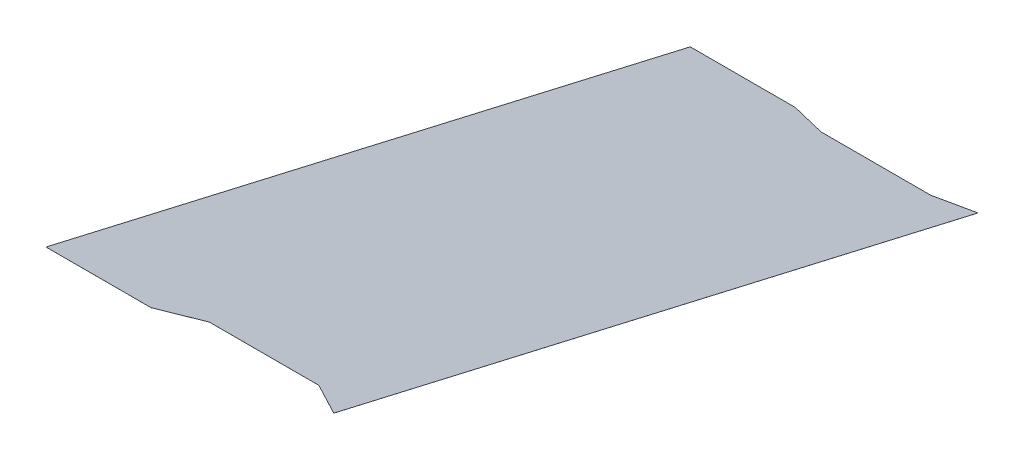
ISO-10303-21;
HEADER;
FILE_DESCRIPTION(('STEP AP214'),'2;1');
FILE_NAME('part.step','',(''),(''),'','','');
FILE_SCHEMA(('AUTOMOTIVE_DESIGN { 1 0 10303 214 1 1 1 1 }'));
ENDSEC;
DATA;
#1=APPLICATION_CONTEXT('core data for automotive mechanical design processes');
#2=APPLICATION_PROTOCOL_DEFINITION('international standard','automotive_design',2000,#1);
#3=PRODUCT_CONTEXT('',#1,'mechanical');
#4=PRODUCT('Part','Part','',(#3));
#5=PRODUCT_RELATED_PRODUCT_CATEGORY('part','',(#4));
#6=PRODUCT_DEFINITION_FORMATION('','',#4);
#7=PRODUCT_DEFINITION_CONTEXT('part definition',#1,'design');
#8=PRODUCT_DEFINITION('design','',#6,#7);
#9=PRODUCT_DEFINITION_SHAPE('','',#8);
#10=(LENGTH_UNIT() NAMED_UNIT(*) SI_UNIT(.MILLI.,.METRE.));
#11=(NAMED_UNIT(*) PLANE_ANGLE_UNIT() SI_UNIT($,.RADIAN.));
#12=(NAMED_UNIT(*) SI_UNIT($,.STERADIAN.) SOLID_ANGLE_UNIT());
#13=UNCERTAINTY_MEASURE_WITH_UNIT(LENGTH_MEASURE(1.E-05),#10,'distance_accuracy_value','');
#14=(GEOMETRIC_REPRESENTATION_CONTEXT(3) GLOBAL_UNCERTAINTY_ASSIGNED_CONTEXT((#13)) GLOBAL_UNIT_ASSIGNED_CONTEXT((#10,
#11,#12)) REPRESENTATION_CONTEXT('',''));
#15=CARTESIAN_POINT('',(0.,0.,0.));
#16=DIRECTION('',(0.,0.,1.));
#17=DIRECTION('',(1.,0.,0.));
#18=AXIS2_PLACEMENT_3D('',#15,#16,#17);
#19=CARTESIAN_POINT('',(259.314030511968,501.787855004575,135.650978246582));
#20=DIRECTION('',(0.519686820333551,0.192188471774977,0.832459728808789));
#21=DIRECTION('',(-0.854356839249036,0.116904098162652,0.506367280796433));
#22=AXIS2_PLACEMENT_3D('',#19,#20,#21);
#23=PLANE('',#22);
#24=DIRECTION('',(0.,0.974370064785232,-0.224951054343882));
#25=VECTOR('',#24,1.);
#26=CARTESIAN_POINT('',(38.4528761102,532.008920592574,266.552794736149));
#27=LINE('',#26,#25);
#28=CARTESIAN_POINT('',(38.4528761102,531.999176891926,266.555044246693));
#29=VERTEX_POINT('',#28);
#30=CARTESIAN_POINT('',(38.4528761102,532.008920592574,266.55279473615));
#31=VERTEX_POINT('',#30);
#32=EDGE_CURVE('E281',#29,#31,#27,.T.);
#33=ORIENTED_EDGE('',*,*,#32,.F.);
#34=DIRECTION('',(-0.854356839249036,0.116904098162652,0.506367280796433));
#35=VECTOR('',#34,1.);
#36=CARTESIAN_POINT('',(259.314030511968,501.778111303927,135.653227757125));
#37=LINE('',#36,#35);
#38=CARTESIAN_POINT('',(63.8128761102004,528.529095313355,251.524469607312));
#39=VERTEX_POINT('',#38);
#40=EDGE_CURVE('E266',#39,#29,#37,.T.);
#41=ORIENTED_EDGE('',*,*,#40,.F.);
#42=DIRECTION('',(-3.33632151107502E-12,0.974370064784918,-0.224951054345237));
#43=VECTOR('',#42,1.);
#44=CARTESIAN_POINT('',(63.8128761102005,528.538839014002,251.522220096769));
#45=LINE('',#44,#43);
#46=CARTESIAN_POINT('',(63.8128761102005,528.538839014002,251.522220096769));
#47=VERTEX_POINT('',#46);
#48=EDGE_CURVE('E284',#39,#47,#45,.T.);
#49=ORIENTED_EDGE('',*,*,#48,.T.);
#50=DIRECTION('',(-0.854356839249036,0.116904098162652,0.506367280796433));
#51=VECTOR('',#50,1.);
#52=CARTESIAN_POINT('',(259.314030511968,501.787855004575,135.650978246582));
#53=LINE('',#52,#51);
#54=EDGE_CURVE('E271',#47,#31,#53,.T.);
#55=ORIENTED_EDGE('',*,*,#54,.T.);
#56=EDGE_LOOP('',(#33,#41,#49,#55));
#57=FACE_BOUND('',#56,.T.);
#58=ADVANCED_FACE('F49',(#57),#23,.T.);
#59=CARTESIAN_POINT('',(62.7729859799619,430.285934628606,-174.05786482689));
#60=DIRECTION('',(0.288887375576382,-0.215359836266688,-0.932825935078874));
#61=DIRECTION('',(0.957363089027664,0.0649855197225443,0.281483210855995));
#62=AXIS2_PLACEMENT_3D('',#59,#60,#61);
#63=PLANE('',#62);
#64=DIRECTION('',(0.,0.974370064785232,-0.224951054343882));
#65=VECTOR('',#64,1.);
#66=CARTESIAN_POINT('',(63.8128761102092,430.356522059167,-173.752117074387));
#67=LINE('',#66,#65);
#68=CARTESIAN_POINT('',(63.8128761102092,430.346778358519,-173.749867563844));
#69=VERTEX_POINT('',#68);
#70=CARTESIAN_POINT('',(63.8128761102092,430.356522059167,-173.752117074387));
#71=VERTEX_POINT('',#70);
#72=EDGE_CURVE('E287',#69,#71,#67,.T.);
#73=ORIENTED_EDGE('',*,*,#72,.F.);
#74=DIRECTION('',(0.957363089027664,0.0649855197225443,0.281483210855995));
#75=VECTOR('',#74,1.);
#76=CARTESIAN_POINT('',(62.7729859799619,430.276190927958,-174.055615316347));
#77=LINE('',#76,#75);
#78=CARTESIAN_POINT('',(38.4528761102093,428.625349154645,-181.206196629714));
#79=VERTEX_POINT('',#78);
#80=EDGE_CURVE('E274',#79,#69,#77,.T.);
#81=ORIENTED_EDGE('',*,*,#80,.F.);
#82=DIRECTION('',(-3.11149537933334E-13,0.974370064785236,-0.224951054343863));
#83=VECTOR('',#82,1.);
#84=CARTESIAN_POINT('',(38.4528761102094,428.635092855292,-181.208446140257));
#85=LINE('',#84,#83);
#86=CARTESIAN_POINT('',(38.4528761102094,428.635092855292,-181.208446140257));
#87=VERTEX_POINT('',#86);
#88=EDGE_CURVE('E276',#79,#87,#85,.T.);
#89=ORIENTED_EDGE('',*,*,#88,.T.);
#90=DIRECTION('',(0.957363089027664,0.0649855197225443,0.281483210855995));
#91=VECTOR('',#90,1.);
#92=CARTESIAN_POINT('',(62.7729859799619,430.285934628606,-174.05786482689));
#93=LINE('',#92,#91);
#94=EDGE_CURVE('E273',#87,#71,#93,.T.);
#95=ORIENTED_EDGE('',*,*,#94,.T.);
#96=EDGE_LOOP('',(#73,#81,#89,#95));
#97=FACE_BOUND('',#96,.T.);
#98=ADVANCED_FACE('F315',(#97),#63,.T.);
#99=CARTESIAN_POINT('',(140.000000000013,429.495807457229,-177.480281607326));
#100=DIRECTION('',(0.,-0.974370064785232,0.224951054343882));
#101=DIRECTION('',(0.,-0.224951054343882,-0.974370064785231));
#102=AXIS2_PLACEMENT_3D('',#99,#100,#101);
#103=PLANE('',#102);
#104=ORIENTED_EDGE('',*,*,#54,.F.);
#105=DIRECTION('',(0.888550493837027,-0.103202782756188,-0.447020363667421));
#106=VECTOR('',#105,1.);
#107=CARTESIAN_POINT('',(63.8128761102005,528.538839014002,251.522220096769));
#108=LINE('',#107,#106);
#109=CARTESIAN_POINT('',(63.8364380551024,528.536102356606,251.51036633128));
#110=VERTEX_POINT('',#109);
#111=EDGE_CURVE('E224',#47,#110,#108,.T.);
#112=ORIENTED_EDGE('',*,*,#111,.T.);
#113=DIRECTION('',(-1.,0.,0.));
#114=VECTOR('',#113,1.);
#115=CARTESIAN_POINT('',(140.016438055104,528.536102356606,251.510366331281));
#116=LINE('',#115,#114);
#117=CARTESIAN_POINT('',(139.996438055103,528.536102356606,251.510366331281));
#118=VERTEX_POINT('',#117);
#119=EDGE_CURVE('E217',#118,#110,#116,.T.);
#120=ORIENTED_EDGE('',*,*,#119,.F.);
#121=DIRECTION('',(0.888550493839736,0.103202782755588,0.447020363662176));
#122=VECTOR('',#121,1.);
#123=CARTESIAN_POINT('',(139.996438055103,528.536102356606,251.510366331282));
#124=LINE('',#123,#122);
#125=CARTESIAN_POINT('',(140.020000000005,528.538839014003,251.52222009677));
#126=VERTEX_POINT('',#125);
#127=EDGE_CURVE('E201',#118,#126,#124,.T.);
#128=ORIENTED_EDGE('',*,*,#127,.T.);
#129=DIRECTION('',(-0.854356839249015,-0.11690409816266,-0.506367280796467));
#130=VECTOR('',#129,1.);
#131=CARTESIAN_POINT('',(-55.4811544017582,501.787855004573,135.650978246575));
#132=LINE('',#131,#130);
#133=CARTESIAN_POINT('',(165.400000000004,532.011657249971,266.56464850164));
#134=VERTEX_POINT('',#133);
#135=EDGE_CURVE('E183',#134,#126,#132,.T.);
#136=ORIENTED_EDGE('',*,*,#135,.F.);
#137=DIRECTION('',(0.,0.224951054343881,0.974370064785231));
#138=VECTOR('',#137,1.);
#139=CARTESIAN_POINT('',(165.400000000013,429.495807457229,-177.480281607326));
#140=LINE('',#139,#138);
#141=CARTESIAN_POINT('',(165.400000000062,428.63373526128,-181.214326525968));
#142=VERTEX_POINT('',#141);
#143=EDGE_CURVE('E174',#142,#134,#140,.T.);
#144=ORIENTED_EDGE('',*,*,#143,.F.);
#145=DIRECTION('',(0.957363089027676,-0.0649855197225351,-0.281483210855958));
#146=VECTOR('',#145,1.);
#147=CARTESIAN_POINT('',(141.059890130261,430.285934628606,-174.057864826889));
#148=LINE('',#147,#146);
#149=CARTESIAN_POINT('',(140.020000000013,430.356522059167,-173.752117074386));
#150=VERTEX_POINT('',#149);
#151=EDGE_CURVE('E169',#150,#142,#148,.T.);
#152=ORIENTED_EDGE('',*,*,#151,.F.);
#153=DIRECTION('',(-0.968727737871945,0.0558162316003546,0.241766660578832));
#154=VECTOR('',#153,1.);
#155=CARTESIAN_POINT('',(140.020000000013,430.356522059167,-173.752117074386));
#156=LINE('',#155,#154);
#157=CARTESIAN_POINT('',(139.996438055111,430.357879653177,-173.746236688688));
#158=VERTEX_POINT('',#157);
#159=EDGE_CURVE('E198',#150,#158,#156,.T.);
#160=ORIENTED_EDGE('',*,*,#159,.T.);
#161=DIRECTION('',(1.,0.,0.));
#162=VECTOR('',#161,1.);
#163=CARTESIAN_POINT('',(140.016438055111,430.357879653177,-173.746236688687));
#164=LINE('',#163,#162);
#165=CARTESIAN_POINT('',(63.8364380551112,430.357879653176,-173.746236688689));
#166=VERTEX_POINT('',#165);
#167=EDGE_CURVE('E209',#166,#158,#164,.T.);
#168=ORIENTED_EDGE('',*,*,#167,.F.);
#169=DIRECTION('',(-0.968727737872594,-0.0558162316016338,-0.241766660575938));
#170=VECTOR('',#169,1.);
#171=CARTESIAN_POINT('',(63.8364380551113,430.357879653176,-173.746236688689));
#172=LINE('',#171,#170);
#173=EDGE_CURVE('E221',#166,#71,#172,.T.);
#174=ORIENTED_EDGE('',*,*,#173,.T.);
#175=ORIENTED_EDGE('',*,*,#94,.F.);
#176=DIRECTION('',(-0.968727737872175,-0.0558162316031102,-0.241766660577276));
#177=VECTOR('',#176,1.);
#178=CARTESIAN_POINT('',(38.4528761102093,428.635092855293,-181.208446140257));
#179=LINE('',#178,#177);
#180=CARTESIAN_POINT('',(38.4293141653076,428.633735261283,-181.214326525956));
#181=VERTEX_POINT('',#180);
#182=EDGE_CURVE('E259',#87,#181,#179,.T.);
#183=ORIENTED_EDGE('',*,*,#182,.T.);
#184=DIRECTION('',(1.,0.,0.));
#185=VECTOR('',#184,1.);
#186=CARTESIAN_POINT('',(-37.7506858346929,428.633735261283,-181.214326525957));
#187=LINE('',#186,#185);
#188=CARTESIAN_POINT('',(-34.6026858346928,428.633735261283,-181.214326525958));
#189=VERTEX_POINT('',#188);
#190=EDGE_CURVE('E245',#189,#181,#187,.T.);
#191=ORIENTED_EDGE('',*,*,#190,.F.);
#192=DIRECTION('',(0.,0.224951054343882,0.974370064785232));
#193=VECTOR('',#192,1.);
#194=CARTESIAN_POINT('',(-34.6026858346926,424.876616092876,-197.488197560722));
#195=LINE('',#194,#193);
#196=CARTESIAN_POINT('',(-34.6026858347022,532.01165724997,266.564648501636));
#197=VERTEX_POINT('',#196);
#198=EDGE_CURVE('E249',#189,#197,#195,.T.);
#199=ORIENTED_EDGE('',*,*,#198,.T.);
#200=DIRECTION('',(-1.,0.,0.));
#201=VECTOR('',#200,1.);
#202=CARTESIAN_POINT('',(-37.750685834704,532.01165724997,266.564648501636));
#203=LINE('',#202,#201);
#204=CARTESIAN_POINT('',(38.4293141652982,532.01165724997,266.564648501638));
#205=VERTEX_POINT('',#204);
#206=EDGE_CURVE('E233',#205,#197,#203,.T.);
#207=ORIENTED_EDGE('',*,*,#206,.F.);
#208=DIRECTION('',(0.888550493840508,-0.103202782755179,-0.447020363660736));
#209=VECTOR('',#208,1.);
#210=CARTESIAN_POINT('',(38.4293141652983,532.01165724997,266.564648501638));
#211=LINE('',#210,#209);
#212=EDGE_CURVE('E262',#205,#31,#211,.T.);
#213=ORIENTED_EDGE('',*,*,#212,.T.);
#214=EDGE_LOOP('',(#104,#112,#120,#128,#136,#144,#152,#160,#168,#174,#175,#183,#191,#199,#207,#213));
#215=FACE_BOUND('',#214,.T.);
#216=ADVANCED_FACE('F51',(#215),#103,.F.);
#217=CARTESIAN_POINT('',(63.8328761102093,429.486063756581,-177.478032096784));
#218=DIRECTION('',(0.,-0.974370064785232,0.224951054343882));
#219=DIRECTION('',(0.,0.224951054343882,0.974370064785232));
#220=AXIS2_PLACEMENT_3D('',#217,#218,#219);
#221=PLANE('',#220);
#222=ORIENTED_EDGE('',*,*,#40,.T.);
#223=DIRECTION('',(0.888550493840508,-0.103202782755179,-0.447020363660736));
#224=VECTOR('',#223,1.);
#225=CARTESIAN_POINT('',(38.4293141652983,532.001913549322,266.566898012181));
#226=LINE('',#225,#224);
#227=CARTESIAN_POINT('',(38.4293141652982,532.001913549322,266.566898012181));
#228=VERTEX_POINT('',#227);
#229=EDGE_CURVE('E263',#228,#29,#226,.T.);
#230=ORIENTED_EDGE('',*,*,#229,.F.);
#231=DIRECTION('',(-1.,0.,0.));
#232=VECTOR('',#231,1.);
#233=CARTESIAN_POINT('',(-37.750685834704,532.001913549322,266.566898012179));
#234=LINE('',#233,#232);
#235=CARTESIAN_POINT('',(-34.6026858347023,532.001913549322,266.566898012179));
#236=VERTEX_POINT('',#235);
#237=EDGE_CURVE('E242',#228,#236,#234,.T.);
#238=ORIENTED_EDGE('',*,*,#237,.T.);
#239=DIRECTION('',(0.,0.224951054343882,0.974370064785232));
#240=VECTOR('',#239,1.);
#241=CARTESIAN_POINT('',(-34.6026858346926,424.866872392228,-197.485948050179));
#242=LINE('',#241,#240);
#243=CARTESIAN_POINT('',(-34.6026858346928,428.623991560635,-181.212077015414));
#244=VERTEX_POINT('',#243);
#245=EDGE_CURVE('E254',#244,#236,#242,.T.);
#246=ORIENTED_EDGE('',*,*,#245,.F.);
#247=DIRECTION('',(1.,0.,0.));
#248=VECTOR('',#247,1.);
#249=CARTESIAN_POINT('',(-37.7506858346929,428.623991560635,-181.212077015414));
#250=LINE('',#249,#248);
#251=CARTESIAN_POINT('',(38.4293141653073,428.623991560635,-181.212077015412));
#252=VERTEX_POINT('',#251);
#253=EDGE_CURVE('E240',#244,#252,#250,.T.);
#254=ORIENTED_EDGE('',*,*,#253,.T.);
#255=DIRECTION('',(-0.968727737872175,-0.0558162316031102,-0.241766660577276));
#256=VECTOR('',#255,1.);
#257=CARTESIAN_POINT('',(38.4528761102093,428.625349154645,-181.206196629714));
#258=LINE('',#257,#256);
#259=EDGE_CURVE('E236',#79,#252,#258,.T.);
#260=ORIENTED_EDGE('',*,*,#259,.F.);
#261=ORIENTED_EDGE('',*,*,#80,.T.);
#262=DIRECTION('',(-0.968727737872594,-0.0558162316016338,-0.241766660575938));
#263=VECTOR('',#262,1.);
#264=CARTESIAN_POINT('',(63.8364380551113,430.348135952529,-173.743987178145));
#265=LINE('',#264,#263);
#266=CARTESIAN_POINT('',(63.8364380551112,430.348135952529,-173.743987178145));
#267=VERTEX_POINT('',#266);
#268=EDGE_CURVE('E211',#267,#69,#265,.T.);
#269=ORIENTED_EDGE('',*,*,#268,.F.);
#270=DIRECTION('',(1.,0.,0.));
#271=VECTOR('',#270,1.);
#272=CARTESIAN_POINT('',(140.016438055111,430.348135952529,-173.743987178144));
#273=LINE('',#272,#271);
#274=CARTESIAN_POINT('',(139.996438055111,430.348135952529,-173.743987178144));
#275=VERTEX_POINT('',#274);
#276=EDGE_CURVE('E64',#267,#275,#273,.T.);
#277=ORIENTED_EDGE('',*,*,#276,.T.);
#278=DIRECTION('',(-0.968727737871945,0.0558162316003546,0.241766660578832));
#279=VECTOR('',#278,1.);
#280=CARTESIAN_POINT('',(140.020000000013,430.34677835852,-173.749867563843));
#281=LINE('',#280,#279);
#282=CARTESIAN_POINT('',(140.020000000013,430.346778358519,-173.749867563843));
#283=VERTEX_POINT('',#282);
#284=EDGE_CURVE('E182',#283,#275,#281,.T.);
#285=ORIENTED_EDGE('',*,*,#284,.F.);
#286=DIRECTION('',(0.957363089027676,-0.0649855197225351,-0.281483210855958));
#287=VECTOR('',#286,1.);
#288=CARTESIAN_POINT('',(141.059890130261,430.276190927958,-174.055615316345));
#289=LINE('',#288,#287);
#290=CARTESIAN_POINT('',(165.400000000062,428.623991560633,-181.212077015424));
#291=VERTEX_POINT('',#290);
#292=EDGE_CURVE('E167',#283,#291,#289,.T.);
#293=ORIENTED_EDGE('',*,*,#292,.T.);
#294=DIRECTION('',(0.,-0.224951054343882,-0.974370064785231));
#295=VECTOR('',#294,1.);
#296=CARTESIAN_POINT('',(165.400000000062,429.486063756581,-177.478032096783));
#297=LINE('',#296,#295);
#298=CARTESIAN_POINT('',(165.400000000004,532.001913549323,266.566898012183));
#299=VERTEX_POINT('',#298);
#300=EDGE_CURVE('E179',#291,#299,#297,.F.);
#301=ORIENTED_EDGE('',*,*,#300,.T.);
#302=DIRECTION('',(-0.854356839249015,-0.11690409816266,-0.506367280796467));
#303=VECTOR('',#302,1.);
#304=CARTESIAN_POINT('',(-55.4811544017582,501.778111303925,135.653227757118));
#305=LINE('',#304,#303);
#306=CARTESIAN_POINT('',(140.020000000005,528.529095313355,251.524469607313));
#307=VERTEX_POINT('',#306);
#308=EDGE_CURVE('E187',#299,#307,#305,.T.);
#309=ORIENTED_EDGE('',*,*,#308,.T.);
#310=DIRECTION('',(0.888550493839736,0.103202782755588,0.447020363662176));
#311=VECTOR('',#310,1.);
#312=CARTESIAN_POINT('',(139.996438055103,528.526358655958,251.512615841825));
#313=LINE('',#312,#311);
#314=CARTESIAN_POINT('',(139.996438055103,528.526358655958,251.512615841825));
#315=VERTEX_POINT('',#314);
#316=EDGE_CURVE('E202',#315,#307,#313,.T.);
#317=ORIENTED_EDGE('',*,*,#316,.F.);
#318=DIRECTION('',(-1.,0.,0.));
#319=VECTOR('',#318,1.);
#320=CARTESIAN_POINT('',(140.016438055104,528.526358655958,251.512615841825));
#321=LINE('',#320,#319);
#322=CARTESIAN_POINT('',(63.8364380551025,528.526358655958,251.512615841824));
#323=VERTEX_POINT('',#322);
#324=EDGE_CURVE('E72',#315,#323,#321,.T.);
#325=ORIENTED_EDGE('',*,*,#324,.T.);
#326=DIRECTION('',(0.888550493837027,-0.103202782756188,-0.447020363667421));
#327=VECTOR('',#326,1.);
#328=CARTESIAN_POINT('',(63.8128761102005,528.529095313355,251.524469607312));
#329=LINE('',#328,#327);
#330=EDGE_CURVE('E225',#39,#323,#329,.T.);
#331=ORIENTED_EDGE('',*,*,#330,.F.);
#332=EDGE_LOOP('',(#222,#230,#238,#246,#254,#260,#261,#269,#277,#285,#293,#301,#309,#317,#325,#331));
#333=FACE_BOUND('',#332,.T.);
#334=ADVANCED_FACE('F178',(#333),#221,.T.);
#335=CARTESIAN_POINT('',(38.4528761102093,428.630221004969,-181.207321384986));
#336=DIRECTION('',(0.248126116878211,-0.217916326006509,-0.943899308709762));
#337=DIRECTION('',(-0.968727737872175,-0.0558162316031102,-0.241766660577276));
#338=AXIS2_PLACEMENT_3D('',#335,#336,#337);
#339=PLANE('',#338);
#340=ORIENTED_EDGE('',*,*,#88,.F.);
#341=ORIENTED_EDGE('',*,*,#259,.T.);
#342=DIRECTION('',(0.,0.974370064785232,-0.224951054343882));
#343=VECTOR('',#342,1.);
#344=CARTESIAN_POINT('',(38.4293141653074,428.633735261283,-181.214326525956));
#345=LINE('',#344,#343);
#346=EDGE_CURVE('E228',#252,#181,#345,.T.);
#347=ORIENTED_EDGE('',*,*,#346,.T.);
#348=ORIENTED_EDGE('',*,*,#182,.F.);
#349=EDGE_LOOP('',(#340,#341,#347,#348));
#350=FACE_BOUND('',#349,.T.);
#351=ADVANCED_FACE('F325',(#350),#339,.T.);
#352=CARTESIAN_POINT('',(38.4293141652983,532.006785399647,266.56577325691));
#353=DIRECTION('',(0.45877883549243,0.199880370427199,0.865777002248325));
#354=DIRECTION('',(0.888550493840508,-0.103202782755179,-0.447020363660736));
#355=AXIS2_PLACEMENT_3D('',#352,#353,#354);
#356=PLANE('',#355);
#357=ORIENTED_EDGE('',*,*,#229,.T.);
#358=ORIENTED_EDGE('',*,*,#32,.T.);
#359=ORIENTED_EDGE('',*,*,#212,.F.);
#360=DIRECTION('',(4.05688350763285E-12,0.974370064785016,-0.224951054344814));
#361=VECTOR('',#360,1.);
#362=CARTESIAN_POINT('',(38.4293141652982,532.01165724997,266.564648501638));
#363=LINE('',#362,#361);
#364=EDGE_CURVE('E237',#228,#205,#363,.T.);
#365=ORIENTED_EDGE('',*,*,#364,.F.);
#366=EDGE_LOOP('',(#357,#358,#359,#365));
#367=FACE_BOUND('',#366,.T.);
#368=ADVANCED_FACE('F326',(#367),#356,.T.);
#369=CARTESIAN_POINT('',(-34.6026858346926,424.876616092876,-197.488197560722));
#370=DIRECTION('',(1.,0.,0.));
#371=DIRECTION('',(0.,0.224951054343882,0.974370064785232));
#372=AXIS2_PLACEMENT_3D('',#369,#370,#371);
#373=PLANE('',#372);
#374=DIRECTION('',(0.,0.974370064785232,-0.224951054343882));
#375=VECTOR('',#374,1.);
#376=CARTESIAN_POINT('',(-34.6026858346928,428.633735261283,-181.214326525958));
#377=LINE('',#376,#375);
#378=EDGE_CURVE('E247',#244,#189,#377,.T.);
#379=ORIENTED_EDGE('',*,*,#378,.F.);
#380=ORIENTED_EDGE('',*,*,#245,.T.);
#381=DIRECTION('',(0.,0.974370064785232,-0.224951054343882));
#382=VECTOR('',#381,1.);
#383=CARTESIAN_POINT('',(-34.6026858347022,532.01165724997,266.564648501636));
#384=LINE('',#383,#382);
#385=EDGE_CURVE('E252',#236,#197,#384,.T.);
#386=ORIENTED_EDGE('',*,*,#385,.T.);
#387=ORIENTED_EDGE('',*,*,#198,.F.);
#388=EDGE_LOOP('',(#379,#380,#386,#387));
#389=FACE_BOUND('',#388,.T.);
#390=ADVANCED_FACE('F329',(#389),#373,.F.);
#391=CARTESIAN_POINT('',(-37.7506858346929,428.633735261283,-181.214326525957));
#392=DIRECTION('',(0.,-0.224951054343882,-0.974370064785232));
#393=DIRECTION('',(1.,0.,0.));
#394=AXIS2_PLACEMENT_3D('',#391,#392,#393);
#395=PLANE('',#394);
#396=ORIENTED_EDGE('',*,*,#346,.F.);
#397=ORIENTED_EDGE('',*,*,#253,.F.);
#398=ORIENTED_EDGE('',*,*,#378,.T.);
#399=ORIENTED_EDGE('',*,*,#190,.T.);
#400=EDGE_LOOP('',(#396,#397,#398,#399));
#401=FACE_BOUND('',#400,.T.);
#402=ADVANCED_FACE('F338',(#401),#395,.T.);
#403=CARTESIAN_POINT('',(-37.750685834704,532.01165724997,266.564648501636));
#404=DIRECTION('',(0.,0.224951054343882,0.974370064785232));
#405=DIRECTION('',(-1.,0.,0.));
#406=AXIS2_PLACEMENT_3D('',#403,#404,#405);
#407=PLANE('',#406);
#408=ORIENTED_EDGE('',*,*,#385,.F.);
#409=ORIENTED_EDGE('',*,*,#237,.F.);
#410=ORIENTED_EDGE('',*,*,#364,.T.);
#411=ORIENTED_EDGE('',*,*,#206,.T.);
#412=EDGE_LOOP('',(#408,#409,#410,#411));
#413=FACE_BOUND('',#412,.T.);
#414=ADVANCED_FACE('F334',(#413),#407,.T.);
#415=CARTESIAN_POINT('',(63.8364380551113,430.353007802853,-173.745111933417));
#416=DIRECTION('',(0.248126116876575,-0.217916326006603,-0.94389930871017));
#417=DIRECTION('',(-0.968727737872594,-0.0558162316016338,-0.241766660575938));
#418=AXIS2_PLACEMENT_3D('',#415,#416,#417);
#419=PLANE('',#418);
#420=DIRECTION('',(-3.39343545773586E-12,0.974370064785225,-0.22495105434391));
#421=VECTOR('',#420,1.);
#422=CARTESIAN_POINT('',(63.8364380551112,430.357879653176,-173.746236688689));
#423=LINE('',#422,#421);
#424=EDGE_CURVE('E212',#267,#166,#423,.T.);
#425=ORIENTED_EDGE('',*,*,#424,.F.);
#426=ORIENTED_EDGE('',*,*,#268,.T.);
#427=ORIENTED_EDGE('',*,*,#72,.T.);
#428=ORIENTED_EDGE('',*,*,#173,.F.);
#429=EDGE_LOOP('',(#425,#426,#427,#428));
#430=FACE_BOUND('',#429,.T.);
#431=ADVANCED_FACE('F337',(#430),#419,.T.);
#432=CARTESIAN_POINT('',(63.8128761102005,528.533967163679,251.523344852041));
#433=DIRECTION('',(0.45877883549917,0.199880370426416,0.865777002244934));
#434=DIRECTION('',(0.888550493837027,-0.103202782756188,-0.447020363667421));
#435=AXIS2_PLACEMENT_3D('',#432,#433,#434);
#436=PLANE('',#435);
#437=ORIENTED_EDGE('',*,*,#330,.T.);
#438=DIRECTION('',(0.,0.974370064785232,-0.224951054343882));
#439=VECTOR('',#438,1.);
#440=CARTESIAN_POINT('',(63.8364380551025,528.536102356606,251.51036633128));
#441=LINE('',#440,#439);
#442=EDGE_CURVE('E205',#323,#110,#441,.T.);
#443=ORIENTED_EDGE('',*,*,#442,.T.);
#444=ORIENTED_EDGE('',*,*,#111,.F.);
#445=ORIENTED_EDGE('',*,*,#48,.F.);
#446=EDGE_LOOP('',(#437,#443,#444,#445));
#447=FACE_BOUND('',#446,.T.);
#448=ADVANCED_FACE('F300',(#447),#436,.T.);
#449=CARTESIAN_POINT('',(140.016438055104,528.536102356606,251.510366331281));
#450=DIRECTION('',(0.,0.224951054343882,0.974370064785231));
#451=DIRECTION('',(-1.,0.,0.));
#452=AXIS2_PLACEMENT_3D('',#449,#450,#451);
#453=PLANE('',#452);
#454=ORIENTED_EDGE('',*,*,#442,.F.);
#455=ORIENTED_EDGE('',*,*,#324,.F.);
#456=DIRECTION('',(-7.27684688407535E-13,0.974370064784557,-0.224951054346801));
#457=VECTOR('',#456,1.);
#458=CARTESIAN_POINT('',(139.996438055103,528.536102356606,251.510366331281));
#459=LINE('',#458,#457);
#460=EDGE_CURVE('E57',#315,#118,#459,.T.);
#461=ORIENTED_EDGE('',*,*,#460,.T.);
#462=ORIENTED_EDGE('',*,*,#119,.T.);
#463=EDGE_LOOP('',(#454,#455,#461,#462));
#464=FACE_BOUND('',#463,.T.);
#465=ADVANCED_FACE('F290',(#464),#453,.T.);
#466=CARTESIAN_POINT('',(140.016438055111,430.357879653177,-173.746236688687));
#467=DIRECTION('',(0.,-0.224951054343882,-0.974370064785231));
#468=DIRECTION('',(1.,0.,0.));
#469=AXIS2_PLACEMENT_3D('',#466,#467,#468);
#470=PLANE('',#469);
#471=DIRECTION('',(0.,0.974370064785232,-0.224951054343882));
#472=VECTOR('',#471,1.);
#473=CARTESIAN_POINT('',(139.996438055111,430.357879653177,-173.746236688687));
#474=LINE('',#473,#472);
#475=EDGE_CURVE('E12',#275,#158,#474,.T.);
#476=ORIENTED_EDGE('',*,*,#475,.F.);
#477=ORIENTED_EDGE('',*,*,#276,.F.);
#478=ORIENTED_EDGE('',*,*,#424,.T.);
#479=ORIENTED_EDGE('',*,*,#167,.T.);
#480=EDGE_LOOP('',(#476,#477,#478,#479));
#481=FACE_BOUND('',#480,.T.);
#482=ADVANCED_FACE('F351',(#481),#470,.T.);
#483=CARTESIAN_POINT('',(140.020000000013,430.351650208843,-173.750992319114));
#484=DIRECTION('',(-0.248126116879108,-0.217916326006457,-0.943899308709537));
#485=DIRECTION('',(-0.968727737871945,0.0558162316003546,0.241766660578832));
#486=AXIS2_PLACEMENT_3D('',#483,#484,#485);
#487=PLANE('',#486);
#488=DIRECTION('',(1.07652890025305E-12,0.974370064785221,-0.224951054343926));
#489=VECTOR('',#488,1.);
#490=CARTESIAN_POINT('',(140.020000000013,430.356522059167,-173.752117074386));
#491=LINE('',#490,#489);
#492=EDGE_CURVE('E189',#283,#150,#491,.T.);
#493=ORIENTED_EDGE('',*,*,#492,.F.);
#494=ORIENTED_EDGE('',*,*,#284,.T.);
#495=ORIENTED_EDGE('',*,*,#475,.T.);
#496=ORIENTED_EDGE('',*,*,#159,.F.);
#497=EDGE_LOOP('',(#493,#494,#495,#496));
#498=FACE_BOUND('',#497,.T.);
#499=ADVANCED_FACE('F354',(#498),#487,.T.);
#500=CARTESIAN_POINT('',(139.996438055103,528.531230506282,251.511491086553));
#501=DIRECTION('',(-0.458778835493925,0.199880370427025,0.865777002247573));
#502=DIRECTION('',(0.888550493839736,0.103202782755588,0.447020363662176));
#503=AXIS2_PLACEMENT_3D('',#500,#501,#502);
#504=PLANE('',#503);
#505=ORIENTED_EDGE('',*,*,#316,.T.);
#506=DIRECTION('',(0.,0.974370064785232,-0.224951054343882));
#507=VECTOR('',#506,1.);
#508=CARTESIAN_POINT('',(140.020000000005,528.538839014003,251.52222009677));
#509=LINE('',#508,#507);
#510=EDGE_CURVE('E175',#307,#126,#509,.T.);
#511=ORIENTED_EDGE('',*,*,#510,.T.);
#512=ORIENTED_EDGE('',*,*,#127,.F.);
#513=ORIENTED_EDGE('',*,*,#460,.F.);
#514=EDGE_LOOP('',(#505,#511,#512,#513));
#515=FACE_BOUND('',#514,.T.);
#516=ADVANCED_FACE('F293',(#515),#504,.T.);
#517=CARTESIAN_POINT('',(165.400000000013,429.495807457229,-177.480281607326));
#518=DIRECTION('',(1.,0.,0.));
#519=DIRECTION('',(0.,0.224951054343881,0.974370064785231));
#520=AXIS2_PLACEMENT_3D('',#517,#518,#519);
#521=PLANE('',#520);
#522=DIRECTION('',(0.,0.974370064785232,-0.224951054343882));
#523=VECTOR('',#522,1.);
#524=CARTESIAN_POINT('',(165.400000000004,532.011657249971,266.56464850164));
#525=LINE('',#524,#523);
#526=EDGE_CURVE('E186',#299,#134,#525,.T.);
#527=ORIENTED_EDGE('',*,*,#526,.F.);
#528=ORIENTED_EDGE('',*,*,#300,.F.);
#529=DIRECTION('',(0.,0.974370064785232,-0.224951054343882));
#530=VECTOR('',#529,1.);
#531=CARTESIAN_POINT('',(165.400000000062,428.63373526128,-181.214326525968));
#532=LINE('',#531,#530);
#533=EDGE_CURVE('E163',#291,#142,#532,.T.);
#534=ORIENTED_EDGE('',*,*,#533,.T.);
#535=ORIENTED_EDGE('',*,*,#143,.T.);
#536=EDGE_LOOP('',(#527,#528,#534,#535));
#537=FACE_BOUND('',#536,.T.);
#538=ADVANCED_FACE('F185',(#537),#521,.T.);
#539=CARTESIAN_POINT('',(-55.4811544017582,501.787855004573,135.650978246575));
#540=DIRECTION('',(-0.519686820333586,0.192188471774972,0.832459728808769));
#541=DIRECTION('',(-0.854356839249015,-0.11690409816266,-0.506367280796467));
#542=AXIS2_PLACEMENT_3D('',#539,#540,#541);
#543=PLANE('',#542);
#544=ORIENTED_EDGE('',*,*,#510,.F.);
#545=ORIENTED_EDGE('',*,*,#308,.F.);
#546=ORIENTED_EDGE('',*,*,#526,.T.);
#547=ORIENTED_EDGE('',*,*,#135,.T.);
#548=EDGE_LOOP('',(#544,#545,#546,#547));
#549=FACE_BOUND('',#548,.T.);
#550=ADVANCED_FACE('F305',(#549),#543,.T.);
#551=CARTESIAN_POINT('',(141.059890130261,430.285934628606,-174.057864826889));
#552=DIRECTION('',(-0.288887375576344,-0.215359836266691,-0.932825935078885));
#553=DIRECTION('',(0.957363089027676,-0.0649855197225351,-0.281483210855958));
#554=AXIS2_PLACEMENT_3D('',#551,#552,#553);
#555=PLANE('',#554);
#556=ORIENTED_EDGE('',*,*,#533,.F.);
#557=ORIENTED_EDGE('',*,*,#292,.F.);
#558=ORIENTED_EDGE('',*,*,#492,.T.);
#559=ORIENTED_EDGE('',*,*,#151,.T.);
#560=EDGE_LOOP('',(#556,#557,#558,#559));
#561=FACE_BOUND('',#560,.T.);
#562=ADVANCED_FACE('F165',(#561),#555,.T.);
#563=CLOSED_SHELL('',(#58,#98,#216,#334,#351,#368,#390,#402,#414,#431,#448,#465,#482,#499,#516,
#538,#550,#562));
#564=MANIFOLD_SOLID_BREP('B2',#563);
#565=ADVANCED_BREP_SHAPE_REPRESENTATION('',(#18,#564),#14);
#566=SHAPE_DEFINITION_REPRESENTATION(#9,#565);
ENDSEC;
END-ISO-10303-21;
